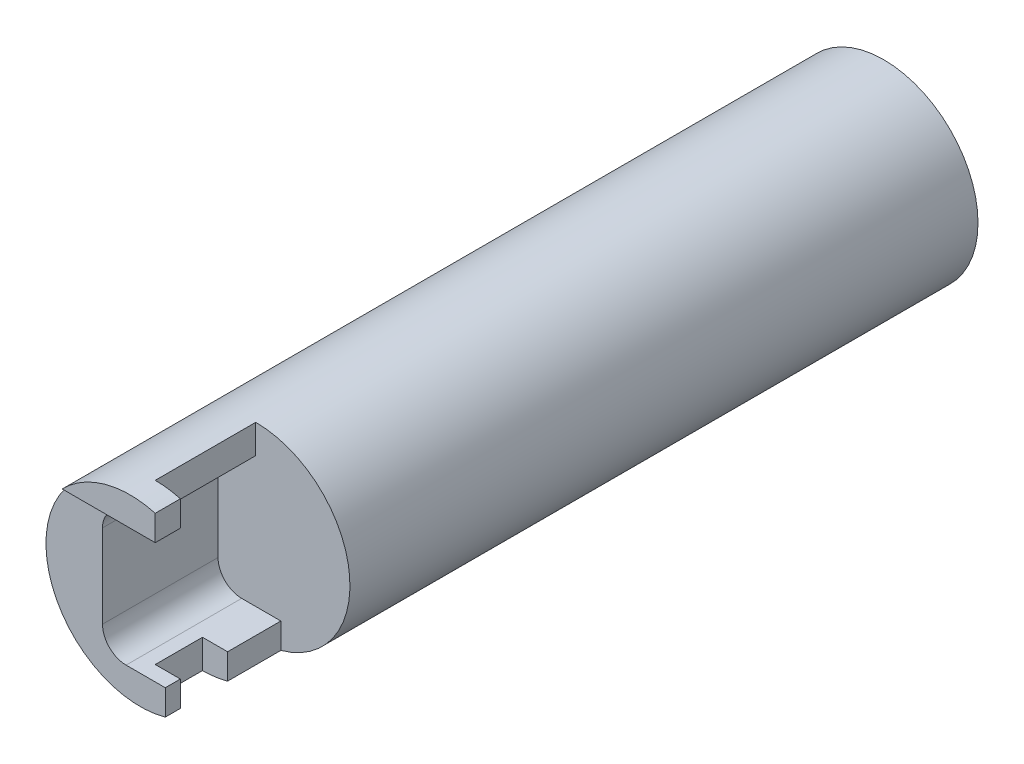
ISO-10303-21;
HEADER;
FILE_DESCRIPTION(('STEP AP214'),'2;1');
FILE_NAME('part.step','',(''),(''),'','','');
FILE_SCHEMA(('AUTOMOTIVE_DESIGN { 1 0 10303 214 1 1 1 1 }'));
ENDSEC;
DATA;
#1=APPLICATION_CONTEXT('core data for automotive mechanical design processes');
#2=APPLICATION_PROTOCOL_DEFINITION('international standard','automotive_design',2000,#1);
#3=PRODUCT_CONTEXT('',#1,'mechanical');
#4=PRODUCT('Part','Part','',(#3));
#5=PRODUCT_RELATED_PRODUCT_CATEGORY('part','',(#4));
#6=PRODUCT_DEFINITION_FORMATION('','',#4);
#7=PRODUCT_DEFINITION_CONTEXT('part definition',#1,'design');
#8=PRODUCT_DEFINITION('design','',#6,#7);
#9=PRODUCT_DEFINITION_SHAPE('','',#8);
#10=(LENGTH_UNIT() NAMED_UNIT(*) SI_UNIT(.MILLI.,.METRE.));
#11=(NAMED_UNIT(*) PLANE_ANGLE_UNIT() SI_UNIT($,.RADIAN.));
#12=(NAMED_UNIT(*) SI_UNIT($,.STERADIAN.) SOLID_ANGLE_UNIT());
#13=UNCERTAINTY_MEASURE_WITH_UNIT(LENGTH_MEASURE(1.E-05),#10,'distance_accuracy_value','');
#14=(GEOMETRIC_REPRESENTATION_CONTEXT(3) GLOBAL_UNCERTAINTY_ASSIGNED_CONTEXT((#13)) GLOBAL_UNIT_ASSIGNED_CONTEXT((#10,
#11,#12)) REPRESENTATION_CONTEXT('',''));
#15=CARTESIAN_POINT('',(0.,0.,0.));
#16=DIRECTION('',(0.,0.,1.));
#17=DIRECTION('',(1.,0.,0.));
#18=AXIS2_PLACEMENT_3D('',#15,#16,#17);
#19=CARTESIAN_POINT('',(1.27,-3.302,31.75));
#20=DIRECTION('',(-1.,0.,0.));
#21=DIRECTION('',(0.,-1.,0.));
#22=AXIS2_PLACEMENT_3D('',#19,#20,#21);
#23=PLANE('',#22);
#24=DIRECTION('',(0.,0.,1.));
#25=VECTOR('',#24,1.);
#26=CARTESIAN_POINT('',(1.27,-3.302,31.75));
#27=LINE('',#26,#25);
#28=CARTESIAN_POINT('',(1.27,-3.302,31.75));
#29=VERTEX_POINT('',#28);
#30=CARTESIAN_POINT('',(1.27,-3.302,34.4424));
#31=VERTEX_POINT('',#30);
#32=EDGE_CURVE('E195',#29,#31,#27,.T.);
#33=ORIENTED_EDGE('',*,*,#32,.T.);
#34=DIRECTION('',(0.,1.,0.));
#35=VECTOR('',#34,1.);
#36=CARTESIAN_POINT('',(1.27,3.302,34.4424));
#37=LINE('',#36,#35);
#38=CARTESIAN_POINT('',(1.27,-4.5900442535993,34.4424));
#39=VERTEX_POINT('',#38);
#40=EDGE_CURVE('E162',#39,#31,#37,.T.);
#41=ORIENTED_EDGE('',*,*,#40,.F.);
#42=DIRECTION('',(0.,0.,-1.));
#43=VECTOR('',#42,1.);
#44=CARTESIAN_POINT('',(1.27,-4.5900442535993,38.1));
#45=LINE('',#44,#43);
#46=CARTESIAN_POINT('',(1.27,-4.5900442535993,31.75));
#47=VERTEX_POINT('',#46);
#48=EDGE_CURVE('E200',#47,#39,#45,.F.);
#49=ORIENTED_EDGE('',*,*,#48,.F.);
#50=DIRECTION('',(0.,-1.,0.));
#51=VECTOR('',#50,1.);
#52=CARTESIAN_POINT('',(1.27,-3.302,31.75));
#53=LINE('',#52,#51);
#54=EDGE_CURVE('E170',#29,#47,#53,.T.);
#55=ORIENTED_EDGE('',*,*,#54,.F.);
#56=EDGE_LOOP('',(#33,#41,#49,#55));
#57=FACE_BOUND('',#56,.T.);
#58=ADVANCED_FACE('F32',(#57),#23,.F.);
#59=CARTESIAN_POINT('',(0.,0.,38.1));
#60=DIRECTION('',(0.,0.,-1.));
#61=DIRECTION('',(-1.,0.,0.));
#62=AXIS2_PLACEMENT_3D('',#59,#60,#61);
#63=CYLINDRICAL_SURFACE('',#62,4.7625);
#64=ORIENTED_EDGE('',*,*,#48,.T.);
#65=CARTESIAN_POINT('',(0.,0.,34.4424));
#66=DIRECTION('',(0.,0.,-1.));
#67=DIRECTION('',(-1.,0.,0.));
#68=AXIS2_PLACEMENT_3D('',#65,#66,#67);
#69=CIRCLE('',#68,4.7625);
#70=CARTESIAN_POINT('',(0.,-4.7625,34.4424));
#71=VERTEX_POINT('',#70);
#72=EDGE_CURVE('E247',#39,#71,#69,.T.);
#73=ORIENTED_EDGE('',*,*,#72,.T.);
#74=DIRECTION('',(0.,0.,-1.));
#75=VECTOR('',#74,1.);
#76=CARTESIAN_POINT('',(0.,-4.7625,38.1));
#77=LINE('',#76,#75);
#78=CARTESIAN_POINT('',(0.,-4.7625,36.83));
#79=VERTEX_POINT('',#78);
#80=EDGE_CURVE('E240',#79,#71,#77,.T.);
#81=ORIENTED_EDGE('',*,*,#80,.F.);
#82=CARTESIAN_POINT('',(0.,0.,36.83));
#83=DIRECTION('',(0.,0.,1.));
#84=DIRECTION('',(1.,0.,0.));
#85=AXIS2_PLACEMENT_3D('',#82,#83,#84);
#86=CIRCLE('',#85,4.7625);
#87=CARTESIAN_POINT('',(1.27,-4.59004425359931,36.83));
#88=VERTEX_POINT('',#87);
#89=EDGE_CURVE('E244',#79,#88,#86,.T.);
#90=ORIENTED_EDGE('',*,*,#89,.T.);
#91=CARTESIAN_POINT('',(1.27,-4.5900442535993,37.592));
#92=VERTEX_POINT('',#91);
#93=EDGE_CURVE('E188',#88,#92,#45,.F.);
#94=ORIENTED_EDGE('',*,*,#93,.T.);
#95=CARTESIAN_POINT('',(0.,0.,37.592));
#96=DIRECTION('',(0.,0.,-1.));
#97=DIRECTION('',(-1.,0.,0.));
#98=AXIS2_PLACEMENT_3D('',#95,#96,#97);
#99=CIRCLE('',#98,4.7625);
#100=CARTESIAN_POINT('',(-3.4319385556854,3.302,37.592));
#101=VERTEX_POINT('',#100);
#102=EDGE_CURVE('E258',#92,#101,#99,.T.);
#103=ORIENTED_EDGE('',*,*,#102,.T.);
#104=DIRECTION('',(0.,0.,-1.));
#105=VECTOR('',#104,1.);
#106=CARTESIAN_POINT('',(-3.4319385556854,3.302,38.1));
#107=LINE('',#106,#105);
#108=CARTESIAN_POINT('',(-3.4319385556854,3.302,38.1));
#109=VERTEX_POINT('',#108);
#110=EDGE_CURVE('E184',#101,#109,#107,.F.);
#111=ORIENTED_EDGE('',*,*,#110,.T.);
#112=CARTESIAN_POINT('',(0.,0.,38.1));
#113=DIRECTION('',(0.,0.,1.));
#114=DIRECTION('',(1.,0.,0.));
#115=AXIS2_PLACEMENT_3D('',#112,#113,#114);
#116=CIRCLE('',#115,4.7625);
#117=CARTESIAN_POINT('',(1.27,4.5900442535993,38.1));
#118=VERTEX_POINT('',#117);
#119=EDGE_CURVE('E207',#118,#109,#116,.T.);
#120=ORIENTED_EDGE('',*,*,#119,.F.);
#121=DIRECTION('',(0.,0.,-1.));
#122=VECTOR('',#121,1.);
#123=CARTESIAN_POINT('',(1.27,4.5900442535993,38.1));
#124=LINE('',#123,#122);
#125=CARTESIAN_POINT('',(1.27,4.5900442535993,36.83));
#126=VERTEX_POINT('',#125);
#127=EDGE_CURVE('E203',#118,#126,#124,.T.);
#128=ORIENTED_EDGE('',*,*,#127,.T.);
#129=CARTESIAN_POINT('',(0.,4.7625,36.83));
#130=VERTEX_POINT('',#129);
#131=EDGE_CURVE('E246',#126,#130,#86,.T.);
#132=ORIENTED_EDGE('',*,*,#131,.T.);
#133=DIRECTION('',(0.,0.,-1.));
#134=VECTOR('',#133,1.);
#135=CARTESIAN_POINT('',(0.,4.7625,38.1));
#136=LINE('',#135,#134);
#137=CARTESIAN_POINT('',(0.,4.7625,31.75));
#138=VERTEX_POINT('',#137);
#139=EDGE_CURVE('E238',#138,#130,#136,.F.);
#140=ORIENTED_EDGE('',*,*,#139,.F.);
#141=CARTESIAN_POINT('',(0.,0.,31.75));
#142=DIRECTION('',(0.,0.,1.));
#143=DIRECTION('',(1.,0.,0.));
#144=AXIS2_PLACEMENT_3D('',#141,#142,#143);
#145=CIRCLE('',#144,4.7625);
#146=EDGE_CURVE('E149',#47,#138,#145,.T.);
#147=ORIENTED_EDGE('',*,*,#146,.F.);
#148=EDGE_LOOP('',(#64,#73,#81,#90,#94,#103,#111,#120,#128,#132,#140,#147));
#149=FACE_BOUND('',#148,.T.);
#150=CARTESIAN_POINT('',(0.,0.,0.));
#151=DIRECTION('',(0.,0.,1.));
#152=DIRECTION('',(1.,0.,0.));
#153=AXIS2_PLACEMENT_3D('',#150,#151,#152);
#154=CIRCLE('',#153,4.7625);
#155=CARTESIAN_POINT('',(4.7625,0.,0.));
#156=VERTEX_POINT('',#155);
#157=EDGE_CURVE('E206',#156,#156,#154,.T.);
#158=ORIENTED_EDGE('',*,*,#157,.T.);
#159=EDGE_LOOP('',(#158));
#160=FACE_BOUND('',#159,.T.);
#161=ADVANCED_FACE('F34',(#149,#160),#63,.T.);
#162=CARTESIAN_POINT('',(0.,0.,38.1));
#163=DIRECTION('',(0.,0.,1.));
#164=DIRECTION('',(1.,0.,0.));
#165=AXIS2_PLACEMENT_3D('',#162,#163,#164);
#166=PLANE('',#165);
#167=ORIENTED_EDGE('',*,*,#119,.T.);
#168=DIRECTION('',(-1.,0.,0.));
#169=VECTOR('',#168,1.);
#170=CARTESIAN_POINT('',(-0.7112,3.302,38.1));
#171=LINE('',#170,#169);
#172=CARTESIAN_POINT('',(1.27,3.302,38.1));
#173=VERTEX_POINT('',#172);
#174=EDGE_CURVE('E181',#173,#109,#171,.T.);
#175=ORIENTED_EDGE('',*,*,#174,.F.);
#176=DIRECTION('',(0.,-1.,0.));
#177=VECTOR('',#176,1.);
#178=CARTESIAN_POINT('',(1.27,0.,38.1));
#179=LINE('',#178,#177);
#180=EDGE_CURVE('E210',#118,#173,#179,.T.);
#181=ORIENTED_EDGE('',*,*,#180,.F.);
#182=EDGE_LOOP('',(#167,#175,#181));
#183=FACE_BOUND('',#182,.T.);
#184=ADVANCED_FACE('F309',(#183),#166,.T.);
#185=CARTESIAN_POINT('',(0.,0.,0.));
#186=DIRECTION('',(0.,0.,1.));
#187=DIRECTION('',(1.,0.,0.));
#188=AXIS2_PLACEMENT_3D('',#185,#186,#187);
#189=PLANE('',#188);
#190=ORIENTED_EDGE('',*,*,#157,.F.);
#191=EDGE_LOOP('',(#190));
#192=FACE_BOUND('',#191,.T.);
#193=ADVANCED_FACE('F324',(#192),#189,.F.);
#194=CARTESIAN_POINT('',(-0.7112,-2.1082,31.75));
#195=DIRECTION('',(0.,0.,1.));
#196=DIRECTION('',(1.,0.,0.));
#197=AXIS2_PLACEMENT_3D('',#194,#195,#196);
#198=PLANE('',#197);
#199=ORIENTED_EDGE('',*,*,#146,.T.);
#200=DIRECTION('',(0.,1.,0.));
#201=VECTOR('',#200,1.);
#202=CARTESIAN_POINT('',(0.,5.90257859379051,31.75));
#203=LINE('',#202,#201);
#204=CARTESIAN_POINT('',(0.,3.302,31.75));
#205=VERTEX_POINT('',#204);
#206=EDGE_CURVE('E140',#205,#138,#203,.T.);
#207=ORIENTED_EDGE('',*,*,#206,.F.);
#208=DIRECTION('',(-1.,0.,0.));
#209=VECTOR('',#208,1.);
#210=CARTESIAN_POINT('',(-0.7112,3.302,31.75));
#211=LINE('',#210,#209);
#212=CARTESIAN_POINT('',(-0.7112,3.302,31.75));
#213=VERTEX_POINT('',#212);
#214=EDGE_CURVE('E145',#205,#213,#211,.T.);
#215=ORIENTED_EDGE('',*,*,#214,.T.);
#216=CARTESIAN_POINT('',(-0.7112,2.1082,31.75));
#217=DIRECTION('',(0.,0.,1.));
#218=DIRECTION('',(-1.,0.,0.));
#219=AXIS2_PLACEMENT_3D('',#216,#217,#218);
#220=CIRCLE('',#219,1.1938);
#221=CARTESIAN_POINT('',(-1.905,2.1082,31.75));
#222=VERTEX_POINT('',#221);
#223=EDGE_CURVE('E169',#213,#222,#220,.T.);
#224=ORIENTED_EDGE('',*,*,#223,.T.);
#225=DIRECTION('',(0.,-1.,0.));
#226=VECTOR('',#225,1.);
#227=CARTESIAN_POINT('',(-1.905,-2.1082,31.75));
#228=LINE('',#227,#226);
#229=CARTESIAN_POINT('',(-1.905,-2.1082,31.75));
#230=VERTEX_POINT('',#229);
#231=EDGE_CURVE('E172',#222,#230,#228,.T.);
#232=ORIENTED_EDGE('',*,*,#231,.T.);
#233=CARTESIAN_POINT('',(-0.7112,-2.1082,31.75));
#234=DIRECTION('',(0.,0.,1.));
#235=DIRECTION('',(1.,0.,0.));
#236=AXIS2_PLACEMENT_3D('',#233,#234,#235);
#237=CIRCLE('',#236,1.1938);
#238=CARTESIAN_POINT('',(-0.7112,-3.302,31.75));
#239=VERTEX_POINT('',#238);
#240=EDGE_CURVE('E183',#230,#239,#237,.T.);
#241=ORIENTED_EDGE('',*,*,#240,.T.);
#242=DIRECTION('',(1.,0.,0.));
#243=VECTOR('',#242,1.);
#244=CARTESIAN_POINT('',(-0.7112,-3.302,31.75));
#245=LINE('',#244,#243);
#246=EDGE_CURVE('E174',#239,#29,#245,.T.);
#247=ORIENTED_EDGE('',*,*,#246,.T.);
#248=ORIENTED_EDGE('',*,*,#54,.T.);
#249=EDGE_LOOP('',(#199,#207,#215,#224,#232,#241,#247,#248));
#250=FACE_BOUND('',#249,.T.);
#251=ADVANCED_FACE('F142',(#250),#198,.T.);
#252=CARTESIAN_POINT('',(1.27,3.302,31.75));
#253=DIRECTION('',(-1.,0.,0.));
#254=DIRECTION('',(0.,0.,1.));
#255=AXIS2_PLACEMENT_3D('',#252,#253,#254);
#256=PLANE('',#255);
#257=DIRECTION('',(0.,0.,1.));
#258=VECTOR('',#257,1.);
#259=CARTESIAN_POINT('',(1.27,3.302,31.75));
#260=LINE('',#259,#258);
#261=CARTESIAN_POINT('',(1.27,3.302,36.83));
#262=VERTEX_POINT('',#261);
#263=EDGE_CURVE('E193',#262,#173,#260,.T.);
#264=ORIENTED_EDGE('',*,*,#263,.F.);
#265=DIRECTION('',(0.,-1.,0.));
#266=VECTOR('',#265,1.);
#267=CARTESIAN_POINT('',(1.27,5.90257859379051,36.83));
#268=LINE('',#267,#266);
#269=EDGE_CURVE('E232',#126,#262,#268,.T.);
#270=ORIENTED_EDGE('',*,*,#269,.F.);
#271=ORIENTED_EDGE('',*,*,#127,.F.);
#272=ORIENTED_EDGE('',*,*,#180,.T.);
#273=EDGE_LOOP('',(#264,#270,#271,#272));
#274=FACE_BOUND('',#273,.T.);
#275=ADVANCED_FACE('F301',(#274),#256,.F.);
#276=ORIENTED_EDGE('',*,*,#93,.F.);
#277=CARTESIAN_POINT('',(1.27,-3.302,36.83));
#278=VERTEX_POINT('',#277);
#279=EDGE_CURVE('E227',#278,#88,#268,.T.);
#280=ORIENTED_EDGE('',*,*,#279,.F.);
#281=CARTESIAN_POINT('',(1.27,-3.302,37.592));
#282=VERTEX_POINT('',#281);
#283=EDGE_CURVE('E55',#278,#282,#27,.T.);
#284=ORIENTED_EDGE('',*,*,#283,.T.);
#285=DIRECTION('',(0.,-1.,0.));
#286=VECTOR('',#285,1.);
#287=CARTESIAN_POINT('',(1.27,-3.302,37.592));
#288=LINE('',#287,#286);
#289=EDGE_CURVE('E256',#282,#92,#288,.T.);
#290=ORIENTED_EDGE('',*,*,#289,.T.);
#291=EDGE_LOOP('',(#276,#280,#284,#290));
#292=FACE_BOUND('',#291,.T.);
#293=ADVANCED_FACE('F231',(#292),#23,.F.);
#294=CARTESIAN_POINT('',(-0.7112,-2.1082,31.75));
#295=DIRECTION('',(0.,0.,1.));
#296=DIRECTION('',(1.,0.,0.));
#297=AXIS2_PLACEMENT_3D('',#294,#295,#296);
#298=CYLINDRICAL_SURFACE('',#297,1.1938);
#299=DIRECTION('',(0.,0.,1.));
#300=VECTOR('',#299,1.);
#301=CARTESIAN_POINT('',(-1.905,-2.1082,31.75));
#302=LINE('',#301,#300);
#303=CARTESIAN_POINT('',(-1.905,-2.1082,37.592));
#304=VERTEX_POINT('',#303);
#305=EDGE_CURVE('E185',#230,#304,#302,.T.);
#306=ORIENTED_EDGE('',*,*,#305,.T.);
#307=CARTESIAN_POINT('',(-0.7112,-2.1082,37.592));
#308=DIRECTION('',(0.,0.,-1.));
#309=DIRECTION('',(-1.,0.,0.));
#310=AXIS2_PLACEMENT_3D('',#307,#308,#309);
#311=CIRCLE('',#310,1.1938);
#312=CARTESIAN_POINT('',(-0.7112,-3.302,37.592));
#313=VERTEX_POINT('',#312);
#314=EDGE_CURVE('E253',#304,#313,#311,.F.);
#315=ORIENTED_EDGE('',*,*,#314,.T.);
#316=DIRECTION('',(0.,0.,1.));
#317=VECTOR('',#316,1.);
#318=CARTESIAN_POINT('',(-0.7112,-3.302,31.75));
#319=LINE('',#318,#317);
#320=EDGE_CURVE('E180',#239,#313,#319,.T.);
#321=ORIENTED_EDGE('',*,*,#320,.F.);
#322=ORIENTED_EDGE('',*,*,#240,.F.);
#323=EDGE_LOOP('',(#306,#315,#321,#322));
#324=FACE_BOUND('',#323,.T.);
#325=ADVANCED_FACE('F293',(#324),#298,.F.);
#326=CARTESIAN_POINT('',(-1.905,-2.1082,31.75));
#327=DIRECTION('',(-1.,0.,0.));
#328=DIRECTION('',(0.,0.,1.));
#329=AXIS2_PLACEMENT_3D('',#326,#327,#328);
#330=PLANE('',#329);
#331=DIRECTION('',(0.,0.,1.));
#332=VECTOR('',#331,1.);
#333=CARTESIAN_POINT('',(-1.905,2.1082,31.75));
#334=LINE('',#333,#332);
#335=CARTESIAN_POINT('',(-1.905,2.1082,37.592));
#336=VERTEX_POINT('',#335);
#337=EDGE_CURVE('E189',#222,#336,#334,.T.);
#338=ORIENTED_EDGE('',*,*,#337,.T.);
#339=DIRECTION('',(0.,-1.,0.));
#340=VECTOR('',#339,1.);
#341=CARTESIAN_POINT('',(-1.905,-2.1082,37.592));
#342=LINE('',#341,#340);
#343=EDGE_CURVE('E261',#336,#304,#342,.T.);
#344=ORIENTED_EDGE('',*,*,#343,.T.);
#345=ORIENTED_EDGE('',*,*,#305,.F.);
#346=ORIENTED_EDGE('',*,*,#231,.F.);
#347=EDGE_LOOP('',(#338,#344,#345,#346));
#348=FACE_BOUND('',#347,.T.);
#349=ADVANCED_FACE('F291',(#348),#330,.F.);
#350=CARTESIAN_POINT('',(-0.7112,2.1082,31.75));
#351=DIRECTION('',(0.,0.,1.));
#352=DIRECTION('',(1.,0.,0.));
#353=AXIS2_PLACEMENT_3D('',#350,#351,#352);
#354=CYLINDRICAL_SURFACE('',#353,1.1938);
#355=DIRECTION('',(0.,0.,1.));
#356=VECTOR('',#355,1.);
#357=CARTESIAN_POINT('',(-0.7112,3.302,31.75));
#358=LINE('',#357,#356);
#359=CARTESIAN_POINT('',(-0.711199999999999,3.302,37.592));
#360=VERTEX_POINT('',#359);
#361=EDGE_CURVE('E167',#213,#360,#358,.T.);
#362=ORIENTED_EDGE('',*,*,#361,.T.);
#363=CARTESIAN_POINT('',(-0.7112,2.1082,37.592));
#364=DIRECTION('',(0.,0.,-1.));
#365=DIRECTION('',(-1.,0.,0.));
#366=AXIS2_PLACEMENT_3D('',#363,#364,#365);
#367=CIRCLE('',#366,1.1938);
#368=EDGE_CURVE('E264',#360,#336,#367,.F.);
#369=ORIENTED_EDGE('',*,*,#368,.T.);
#370=ORIENTED_EDGE('',*,*,#337,.F.);
#371=ORIENTED_EDGE('',*,*,#223,.F.);
#372=EDGE_LOOP('',(#362,#369,#370,#371));
#373=FACE_BOUND('',#372,.T.);
#374=ADVANCED_FACE('F288',(#373),#354,.F.);
#375=CARTESIAN_POINT('',(-0.7112,3.302,31.75));
#376=DIRECTION('',(0.,1.,0.));
#377=DIRECTION('',(0.,0.,1.));
#378=AXIS2_PLACEMENT_3D('',#375,#376,#377);
#379=PLANE('',#378);
#380=DIRECTION('',(0.,0.,-1.));
#381=VECTOR('',#380,1.);
#382=CARTESIAN_POINT('',(0.,3.302,31.75));
#383=LINE('',#382,#381);
#384=CARTESIAN_POINT('',(0.,3.302,36.83));
#385=VERTEX_POINT('',#384);
#386=EDGE_CURVE('E153',#385,#205,#383,.T.);
#387=ORIENTED_EDGE('',*,*,#386,.F.);
#388=DIRECTION('',(1.,0.,0.));
#389=VECTOR('',#388,1.);
#390=CARTESIAN_POINT('',(-0.7112,3.302,36.83));
#391=LINE('',#390,#389);
#392=EDGE_CURVE('E242',#385,#262,#391,.T.);
#393=ORIENTED_EDGE('',*,*,#392,.T.);
#394=ORIENTED_EDGE('',*,*,#263,.T.);
#395=ORIENTED_EDGE('',*,*,#174,.T.);
#396=ORIENTED_EDGE('',*,*,#110,.F.);
#397=DIRECTION('',(-1.,0.,0.));
#398=VECTOR('',#397,1.);
#399=CARTESIAN_POINT('',(-6.2579328984782,3.302,37.592));
#400=LINE('',#399,#398);
#401=EDGE_CURVE('E250',#360,#101,#400,.T.);
#402=ORIENTED_EDGE('',*,*,#401,.F.);
#403=ORIENTED_EDGE('',*,*,#361,.F.);
#404=ORIENTED_EDGE('',*,*,#214,.F.);
#405=EDGE_LOOP('',(#387,#393,#394,#395,#396,#402,#403,#404));
#406=FACE_BOUND('',#405,.T.);
#407=ADVANCED_FACE('F164',(#406),#379,.F.);
#408=CARTESIAN_POINT('',(-0.7112,-3.302,31.75));
#409=DIRECTION('',(0.,-1.,0.));
#410=DIRECTION('',(0.,0.,-1.));
#411=AXIS2_PLACEMENT_3D('',#408,#409,#410);
#412=PLANE('',#411);
#413=DIRECTION('',(0.,0.,1.));
#414=VECTOR('',#413,1.);
#415=CARTESIAN_POINT('',(0.,-3.302,31.75));
#416=LINE('',#415,#414);
#417=CARTESIAN_POINT('',(0.,-3.302,34.4424));
#418=VERTEX_POINT('',#417);
#419=CARTESIAN_POINT('',(0.,-3.302,36.83));
#420=VERTEX_POINT('',#419);
#421=EDGE_CURVE('E219',#418,#420,#416,.T.);
#422=ORIENTED_EDGE('',*,*,#421,.F.);
#423=DIRECTION('',(1.,0.,0.));
#424=VECTOR('',#423,1.);
#425=CARTESIAN_POINT('',(-0.7112,-3.302,34.4424));
#426=LINE('',#425,#424);
#427=EDGE_CURVE('E11',#418,#31,#426,.T.);
#428=ORIENTED_EDGE('',*,*,#427,.T.);
#429=ORIENTED_EDGE('',*,*,#32,.F.);
#430=ORIENTED_EDGE('',*,*,#246,.F.);
#431=ORIENTED_EDGE('',*,*,#320,.T.);
#432=DIRECTION('',(1.,0.,0.));
#433=VECTOR('',#432,1.);
#434=CARTESIAN_POINT('',(-0.7112,-3.302,37.592));
#435=LINE('',#434,#433);
#436=EDGE_CURVE('E216',#313,#282,#435,.T.);
#437=ORIENTED_EDGE('',*,*,#436,.T.);
#438=ORIENTED_EDGE('',*,*,#283,.F.);
#439=DIRECTION('',(-1.,0.,0.));
#440=VECTOR('',#439,1.);
#441=CARTESIAN_POINT('',(-0.7112,-3.302,36.83));
#442=LINE('',#441,#440);
#443=EDGE_CURVE('E40',#278,#420,#442,.T.);
#444=ORIENTED_EDGE('',*,*,#443,.T.);
#445=EDGE_LOOP('',(#422,#428,#429,#430,#431,#437,#438,#444));
#446=FACE_BOUND('',#445,.T.);
#447=ADVANCED_FACE('F223',(#446),#412,.F.);
#448=CARTESIAN_POINT('',(-6.2579328984782,3.302,37.592));
#449=DIRECTION('',(0.,0.,-1.));
#450=DIRECTION('',(-1.,0.,0.));
#451=AXIS2_PLACEMENT_3D('',#448,#449,#450);
#452=PLANE('',#451);
#453=ORIENTED_EDGE('',*,*,#401,.T.);
#454=ORIENTED_EDGE('',*,*,#102,.F.);
#455=ORIENTED_EDGE('',*,*,#289,.F.);
#456=ORIENTED_EDGE('',*,*,#436,.F.);
#457=ORIENTED_EDGE('',*,*,#314,.F.);
#458=ORIENTED_EDGE('',*,*,#343,.F.);
#459=ORIENTED_EDGE('',*,*,#368,.F.);
#460=EDGE_LOOP('',(#453,#454,#455,#456,#457,#458,#459));
#461=FACE_BOUND('',#460,.T.);
#462=ADVANCED_FACE('F286',(#461),#452,.F.);
#463=CARTESIAN_POINT('',(0.,3.302,34.4424));
#464=DIRECTION('',(1.,0.,0.));
#465=DIRECTION('',(0.,1.,0.));
#466=AXIS2_PLACEMENT_3D('',#463,#464,#465);
#467=PLANE('',#466);
#468=ORIENTED_EDGE('',*,*,#80,.T.);
#469=DIRECTION('',(0.,1.,0.));
#470=VECTOR('',#469,1.);
#471=CARTESIAN_POINT('',(0.,3.302,34.4424));
#472=LINE('',#471,#470);
#473=EDGE_CURVE('E47',#71,#418,#472,.T.);
#474=ORIENTED_EDGE('',*,*,#473,.T.);
#475=ORIENTED_EDGE('',*,*,#421,.T.);
#476=DIRECTION('',(0.,-1.,0.));
#477=VECTOR('',#476,1.);
#478=CARTESIAN_POINT('',(0.,5.90257859379051,36.83));
#479=LINE('',#478,#477);
#480=EDGE_CURVE('E152',#420,#79,#479,.T.);
#481=ORIENTED_EDGE('',*,*,#480,.T.);
#482=EDGE_LOOP('',(#468,#474,#475,#481));
#483=FACE_BOUND('',#482,.T.);
#484=ADVANCED_FACE('F283',(#483),#467,.T.);
#485=CARTESIAN_POINT('',(0.,5.90257859379051,36.83));
#486=DIRECTION('',(0.,0.,1.));
#487=DIRECTION('',(1.,0.,0.));
#488=AXIS2_PLACEMENT_3D('',#485,#486,#487);
#489=PLANE('',#488);
#490=ORIENTED_EDGE('',*,*,#480,.F.);
#491=ORIENTED_EDGE('',*,*,#443,.F.);
#492=ORIENTED_EDGE('',*,*,#279,.T.);
#493=ORIENTED_EDGE('',*,*,#89,.F.);
#494=EDGE_LOOP('',(#490,#491,#492,#493));
#495=FACE_BOUND('',#494,.T.);
#496=ADVANCED_FACE('F226',(#495),#489,.F.);
#497=CARTESIAN_POINT('',(0.,3.302,34.4424));
#498=DIRECTION('',(0.,0.,-1.));
#499=DIRECTION('',(-1.,0.,0.));
#500=AXIS2_PLACEMENT_3D('',#497,#498,#499);
#501=PLANE('',#500);
#502=ORIENTED_EDGE('',*,*,#40,.T.);
#503=ORIENTED_EDGE('',*,*,#427,.F.);
#504=ORIENTED_EDGE('',*,*,#473,.F.);
#505=ORIENTED_EDGE('',*,*,#72,.F.);
#506=EDGE_LOOP('',(#502,#503,#504,#505));
#507=FACE_BOUND('',#506,.T.);
#508=ADVANCED_FACE('F328',(#507),#501,.F.);
#509=ORIENTED_EDGE('',*,*,#269,.T.);
#510=ORIENTED_EDGE('',*,*,#392,.F.);
#511=EDGE_CURVE('E158',#130,#385,#479,.T.);
#512=ORIENTED_EDGE('',*,*,#511,.F.);
#513=ORIENTED_EDGE('',*,*,#131,.F.);
#514=EDGE_LOOP('',(#509,#510,#512,#513));
#515=FACE_BOUND('',#514,.T.);
#516=ADVANCED_FACE('F281',(#515),#489,.F.);
#517=ORIENTED_EDGE('',*,*,#139,.T.);
#518=ORIENTED_EDGE('',*,*,#511,.T.);
#519=ORIENTED_EDGE('',*,*,#386,.T.);
#520=ORIENTED_EDGE('',*,*,#206,.T.);
#521=EDGE_LOOP('',(#517,#518,#519,#520));
#522=FACE_BOUND('',#521,.T.);
#523=ADVANCED_FACE('F156',(#522),#467,.T.);
#524=CLOSED_SHELL('',(#58,#161,#184,#193,#251,#275,#293,#325,#349,#374,#407,#447,#462,#484,#496,
#508,#516,#523));
#525=MANIFOLD_SOLID_BREP('B2',#524);
#526=ADVANCED_BREP_SHAPE_REPRESENTATION('',(#18,#525),#14);
#527=SHAPE_DEFINITION_REPRESENTATION(#9,#526);
ENDSEC;
END-ISO-10303-21;
